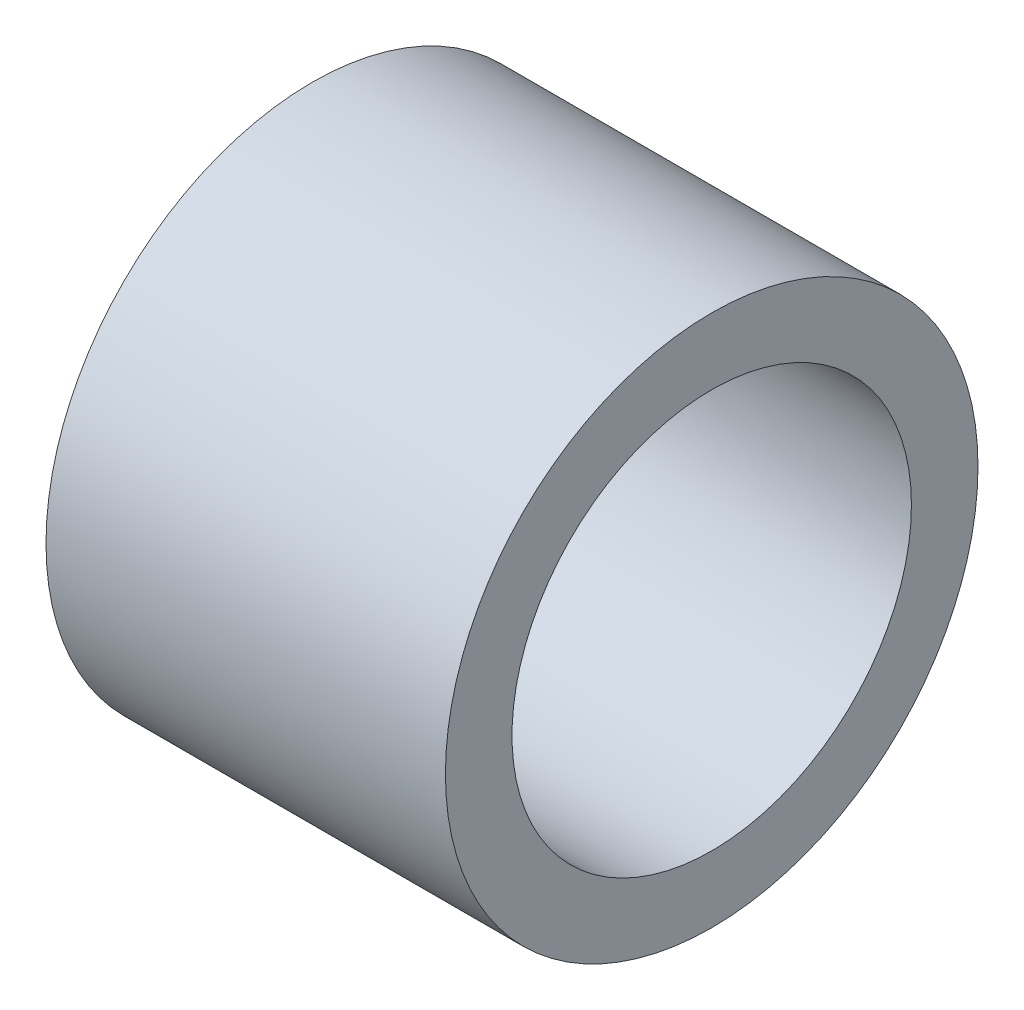
ISO-10303-21;
HEADER;
FILE_DESCRIPTION(('STEP AP214'),'2;1');
FILE_NAME('part.step','',(''),(''),'','','');
FILE_SCHEMA(('AUTOMOTIVE_DESIGN { 1 0 10303 214 1 1 1 1 }'));
ENDSEC;
DATA;
#1=APPLICATION_CONTEXT('core data for automotive mechanical design processes');
#2=APPLICATION_PROTOCOL_DEFINITION('international standard','automotive_design',2000,#1);
#3=PRODUCT_CONTEXT('',#1,'mechanical');
#4=PRODUCT('Part','Part','',(#3));
#5=PRODUCT_RELATED_PRODUCT_CATEGORY('part','',(#4));
#6=PRODUCT_DEFINITION_FORMATION('','',#4);
#7=PRODUCT_DEFINITION_CONTEXT('part definition',#1,'design');
#8=PRODUCT_DEFINITION('design','',#6,#7);
#9=PRODUCT_DEFINITION_SHAPE('','',#8);
#10=(LENGTH_UNIT() NAMED_UNIT(*) SI_UNIT(.MILLI.,.METRE.));
#11=(NAMED_UNIT(*) PLANE_ANGLE_UNIT() SI_UNIT($,.RADIAN.));
#12=(NAMED_UNIT(*) SI_UNIT($,.STERADIAN.) SOLID_ANGLE_UNIT());
#13=UNCERTAINTY_MEASURE_WITH_UNIT(LENGTH_MEASURE(1.E-05),#10,'distance_accuracy_value','');
#14=(GEOMETRIC_REPRESENTATION_CONTEXT(3) GLOBAL_UNCERTAINTY_ASSIGNED_CONTEXT((#13)) GLOBAL_UNIT_ASSIGNED_CONTEXT((#10,
#11,#12)) REPRESENTATION_CONTEXT('',''));
#15=CARTESIAN_POINT('',(0.,0.,0.));
#16=DIRECTION('',(0.,0.,1.));
#17=DIRECTION('',(1.,0.,0.));
#18=AXIS2_PLACEMENT_3D('',#15,#16,#17);
#19=CARTESIAN_POINT('',(9.525,0.,0.));
#20=DIRECTION('',(1.,0.,0.));
#21=DIRECTION('',(0.,0.,-1.));
#22=AXIS2_PLACEMENT_3D('',#19,#20,#21);
#23=PLANE('',#22);
#24=CARTESIAN_POINT('',(9.525,0.,0.));
#25=DIRECTION('',(1.,0.,0.));
#26=DIRECTION('',(0.,0.,-1.));
#27=AXIS2_PLACEMENT_3D('',#24,#25,#26);
#28=CIRCLE('',#27,12.7);
#29=CARTESIAN_POINT('',(9.525,0.,-12.7));
#30=VERTEX_POINT('',#29);
#31=EDGE_CURVE('E10',#30,#30,#28,.T.);
#32=ORIENTED_EDGE('',*,*,#31,.T.);
#33=EDGE_LOOP('',(#32));
#34=FACE_BOUND('',#33,.T.);
#35=CARTESIAN_POINT('',(9.525,0.,0.));
#36=DIRECTION('',(1.,0.,0.));
#37=DIRECTION('',(0.,0.,-1.));
#38=AXIS2_PLACEMENT_3D('',#35,#36,#37);
#39=CIRCLE('',#38,9.525);
#40=CARTESIAN_POINT('',(9.525,0.,-9.525));
#41=VERTEX_POINT('',#40);
#42=EDGE_CURVE('E41',#41,#41,#39,.T.);
#43=ORIENTED_EDGE('',*,*,#42,.F.);
#44=EDGE_LOOP('',(#43));
#45=FACE_BOUND('',#44,.T.);
#46=ADVANCED_FACE('F30',(#34,#45),#23,.T.);
#47=CARTESIAN_POINT('',(-9.525,0.,0.));
#48=DIRECTION('',(1.,0.,0.));
#49=DIRECTION('',(0.,0.,-1.));
#50=AXIS2_PLACEMENT_3D('',#47,#48,#49);
#51=PLANE('',#50);
#52=CARTESIAN_POINT('',(-9.525,0.,0.));
#53=DIRECTION('',(1.,0.,0.));
#54=DIRECTION('',(0.,0.,-1.));
#55=AXIS2_PLACEMENT_3D('',#52,#53,#54);
#56=CIRCLE('',#55,12.7);
#57=CARTESIAN_POINT('',(-9.525,0.,-12.7));
#58=VERTEX_POINT('',#57);
#59=EDGE_CURVE('E34',#58,#58,#56,.T.);
#60=ORIENTED_EDGE('',*,*,#59,.F.);
#61=EDGE_LOOP('',(#60));
#62=FACE_BOUND('',#61,.T.);
#63=CARTESIAN_POINT('',(-9.525,0.,0.));
#64=DIRECTION('',(1.,0.,0.));
#65=DIRECTION('',(0.,0.,-1.));
#66=AXIS2_PLACEMENT_3D('',#63,#64,#65);
#67=CIRCLE('',#66,9.525);
#68=CARTESIAN_POINT('',(-9.525,0.,-9.525));
#69=VERTEX_POINT('',#68);
#70=EDGE_CURVE('E43',#69,#69,#67,.T.);
#71=ORIENTED_EDGE('',*,*,#70,.T.);
#72=EDGE_LOOP('',(#71));
#73=FACE_BOUND('',#72,.T.);
#74=ADVANCED_FACE('F53',(#62,#73),#51,.F.);
#75=CARTESIAN_POINT('',(9.525,0.,0.));
#76=DIRECTION('',(-1.,0.,0.));
#77=DIRECTION('',(0.,0.,1.));
#78=AXIS2_PLACEMENT_3D('',#75,#76,#77);
#79=CYLINDRICAL_SURFACE('',#78,12.7);
#80=ORIENTED_EDGE('',*,*,#31,.F.);
#81=EDGE_LOOP('',(#80));
#82=FACE_BOUND('',#81,.T.);
#83=ORIENTED_EDGE('',*,*,#59,.T.);
#84=EDGE_LOOP('',(#83));
#85=FACE_BOUND('',#84,.T.);
#86=ADVANCED_FACE('F32',(#82,#85),#79,.T.);
#87=CARTESIAN_POINT('',(9.525,0.,0.));
#88=DIRECTION('',(-1.,0.,0.));
#89=DIRECTION('',(0.,0.,1.));
#90=AXIS2_PLACEMENT_3D('',#87,#88,#89);
#91=CYLINDRICAL_SURFACE('',#90,9.525);
#92=ORIENTED_EDGE('',*,*,#42,.T.);
#93=EDGE_LOOP('',(#92));
#94=FACE_BOUND('',#93,.T.);
#95=ORIENTED_EDGE('',*,*,#70,.F.);
#96=EDGE_LOOP('',(#95));
#97=FACE_BOUND('',#96,.T.);
#98=ADVANCED_FACE('F49',(#94,#97),#91,.F.);
#99=CLOSED_SHELL('',(#46,#74,#86,#98));
#100=MANIFOLD_SOLID_BREP('B2',#99);
#101=ADVANCED_BREP_SHAPE_REPRESENTATION('',(#18,#100),#14);
#102=SHAPE_DEFINITION_REPRESENTATION(#9,#101);
ENDSEC;
END-ISO-10303-21;
